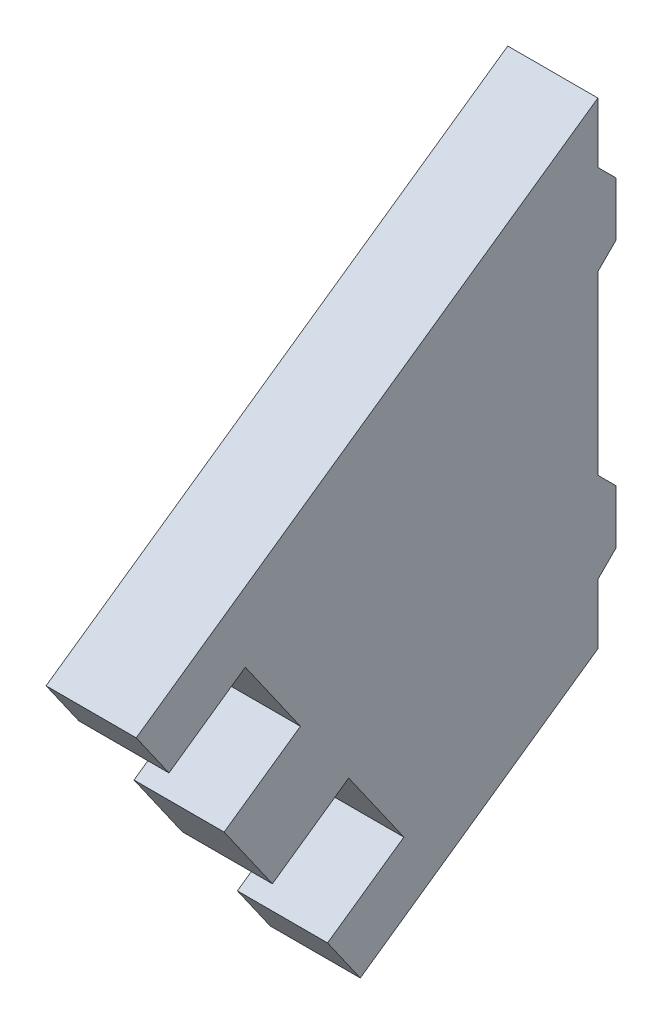
ISO-10303-21;
HEADER;
FILE_DESCRIPTION(('STEP AP214'),'2;1');
FILE_NAME('part.step','',(''),(''),'','','');
FILE_SCHEMA(('AUTOMOTIVE_DESIGN { 1 0 10303 214 1 1 1 1 }'));
ENDSEC;
DATA;
#1=APPLICATION_CONTEXT('core data for automotive mechanical design processes');
#2=APPLICATION_PROTOCOL_DEFINITION('international standard','automotive_design',2000,#1);
#3=PRODUCT_CONTEXT('',#1,'mechanical');
#4=PRODUCT('Part','Part','',(#3));
#5=PRODUCT_RELATED_PRODUCT_CATEGORY('part','',(#4));
#6=PRODUCT_DEFINITION_FORMATION('','',#4);
#7=PRODUCT_DEFINITION_CONTEXT('part definition',#1,'design');
#8=PRODUCT_DEFINITION('design','',#6,#7);
#9=PRODUCT_DEFINITION_SHAPE('','',#8);
#10=(LENGTH_UNIT() NAMED_UNIT(*) SI_UNIT(.MILLI.,.METRE.));
#11=(NAMED_UNIT(*) PLANE_ANGLE_UNIT() SI_UNIT($,.RADIAN.));
#12=(NAMED_UNIT(*) SI_UNIT($,.STERADIAN.) SOLID_ANGLE_UNIT());
#13=UNCERTAINTY_MEASURE_WITH_UNIT(LENGTH_MEASURE(1.E-05),#10,'distance_accuracy_value','');
#14=(GEOMETRIC_REPRESENTATION_CONTEXT(3) GLOBAL_UNCERTAINTY_ASSIGNED_CONTEXT((#13)) GLOBAL_UNIT_ASSIGNED_CONTEXT((#10,
#11,#12)) REPRESENTATION_CONTEXT('',''));
#15=CARTESIAN_POINT('',(0.,0.,0.));
#16=DIRECTION('',(0.,0.,1.));
#17=DIRECTION('',(1.,0.,0.));
#18=AXIS2_PLACEMENT_3D('',#15,#16,#17);
#19=CARTESIAN_POINT('',(-653.,-209.350348269495,0.));
#20=DIRECTION('',(0.,0.,1.));
#21=DIRECTION('',(0.,-1.,0.));
#22=AXIS2_PLACEMENT_3D('',#19,#20,#21);
#23=PLANE('',#22);
#24=CARTESIAN_POINT('',(-653.,-184.350348269495,0.));
#25=CARTESIAN_POINT('',(-668.,-184.350348269495,0.));
#26=B_SPLINE_CURVE_WITH_KNOTS('',1,(#24,#25),.UNSPECIFIED.,.F.,.F.,(2,2),(0.,0.25),.UNSPECIFIED.);
#27=CARTESIAN_POINT('',(-653.,-184.350348269495,0.));
#28=VERTEX_POINT('',#27);
#29=CARTESIAN_POINT('',(-668.,-184.350348269495,0.));
#30=VERTEX_POINT('',#29);
#31=EDGE_CURVE('E207',#28,#30,#26,.T.);
#32=ORIENTED_EDGE('',*,*,#31,.T.);
#33=DIRECTION('',(0.,-1.,0.));
#34=VECTOR('',#33,1.);
#35=CARTESIAN_POINT('',(-668.,-209.350348269495,0.));
#36=LINE('',#35,#34);
#37=CARTESIAN_POINT('',(-668.,-155.,0.));
#38=VERTEX_POINT('',#37);
#39=EDGE_CURVE('E396',#38,#30,#36,.T.);
#40=ORIENTED_EDGE('',*,*,#39,.F.);
#41=CARTESIAN_POINT('',(-668.,-155.,0.));
#42=CARTESIAN_POINT('',(-653.,-155.,0.));
#43=B_SPLINE_CURVE_WITH_KNOTS('',1,(#41,#42),.UNSPECIFIED.,.F.,.F.,(2,2),(0.5,0.75),.UNSPECIFIED.);
#44=CARTESIAN_POINT('',(-653.,-155.,0.));
#45=VERTEX_POINT('',#44);
#46=EDGE_CURVE('E243',#38,#45,#43,.T.);
#47=ORIENTED_EDGE('',*,*,#46,.T.);
#48=DIRECTION('',(0.,-1.,0.));
#49=VECTOR('',#48,1.);
#50=CARTESIAN_POINT('',(-653.,-209.350348269495,0.));
#51=LINE('',#50,#49);
#52=EDGE_CURVE('E200',#45,#28,#51,.T.);
#53=ORIENTED_EDGE('',*,*,#52,.T.);
#54=EDGE_LOOP('',(#32,#40,#47,#53));
#55=FACE_BOUND('',#54,.T.);
#56=ADVANCED_FACE('F41',(#55),#23,.F.);
#57=CARTESIAN_POINT('',(-668.,-199.350348269495,0.));
#58=CARTESIAN_POINT('',(-653.,-199.350348269495,0.));
#59=B_SPLINE_CURVE_WITH_KNOTS('',1,(#57,#58),.UNSPECIFIED.,.F.,.F.,(2,2),(0.5,0.75),.UNSPECIFIED.);
#60=CARTESIAN_POINT('',(-668.,-199.350348269495,0.));
#61=VERTEX_POINT('',#60);
#62=CARTESIAN_POINT('',(-653.,-199.350348269495,0.));
#63=VERTEX_POINT('',#62);
#64=EDGE_CURVE('E185',#61,#63,#59,.T.);
#65=ORIENTED_EDGE('',*,*,#64,.T.);
#66=CARTESIAN_POINT('',(-653.,-209.350348269495,0.));
#67=VERTEX_POINT('',#66);
#68=EDGE_CURVE('E192',#63,#67,#51,.T.);
#69=ORIENTED_EDGE('',*,*,#68,.T.);
#70=DIRECTION('',(-1.,0.,0.));
#71=VECTOR('',#70,1.);
#72=CARTESIAN_POINT('',(-653.,-209.350348269495,0.));
#73=LINE('',#72,#71);
#74=CARTESIAN_POINT('',(-668.,-209.350348269495,0.));
#75=VERTEX_POINT('',#74);
#76=EDGE_CURVE('E419',#67,#75,#73,.T.);
#77=ORIENTED_EDGE('',*,*,#76,.T.);
#78=EDGE_CURVE('E205',#61,#75,#36,.T.);
#79=ORIENTED_EDGE('',*,*,#78,.F.);
#80=EDGE_LOOP('',(#65,#69,#77,#79));
#81=FACE_BOUND('',#80,.T.);
#82=ADVANCED_FACE('F204',(#81),#23,.F.);
#83=CARTESIAN_POINT('',(-653.,-140.,0.));
#84=CARTESIAN_POINT('',(-668.,-140.,0.));
#85=B_SPLINE_CURVE_WITH_KNOTS('',1,(#83,#84),.UNSPECIFIED.,.F.,.F.,(2,2),(0.,0.25),.UNSPECIFIED.);
#86=CARTESIAN_POINT('',(-653.,-140.,0.));
#87=VERTEX_POINT('',#86);
#88=CARTESIAN_POINT('',(-668.,-140.,0.));
#89=VERTEX_POINT('',#88);
#90=EDGE_CURVE('E242',#87,#89,#85,.T.);
#91=ORIENTED_EDGE('',*,*,#90,.T.);
#92=CARTESIAN_POINT('',(-668.,-130.,0.));
#93=VERTEX_POINT('',#92);
#94=EDGE_CURVE('E399',#93,#89,#36,.T.);
#95=ORIENTED_EDGE('',*,*,#94,.F.);
#96=DIRECTION('',(-1.,0.,0.));
#97=VECTOR('',#96,1.);
#98=CARTESIAN_POINT('',(-653.,-130.,0.));
#99=LINE('',#98,#97);
#100=CARTESIAN_POINT('',(-653.,-130.,0.));
#101=VERTEX_POINT('',#100);
#102=EDGE_CURVE('E410',#101,#93,#99,.T.);
#103=ORIENTED_EDGE('',*,*,#102,.F.);
#104=EDGE_CURVE('E203',#101,#87,#51,.T.);
#105=ORIENTED_EDGE('',*,*,#104,.T.);
#106=EDGE_LOOP('',(#91,#95,#103,#105));
#107=FACE_BOUND('',#106,.T.);
#108=ADVANCED_FACE('F43',(#107),#23,.F.);
#109=CARTESIAN_POINT('',(-653.,-183.785541406649,76.8137137514509));
#110=DIRECTION('',(0.,0.57357643635105,-0.819152044288989));
#111=DIRECTION('',(0.,0.819152044288989,0.57357643635105));
#112=AXIS2_PLACEMENT_3D('',#109,#110,#111);
#113=PLANE('',#112);
#114=DIRECTION('',(0.,0.819152044288989,0.57357643635105));
#115=VECTOR('',#114,1.);
#116=CARTESIAN_POINT('',(-668.,-183.785541406649,76.8137137514509));
#117=LINE('',#116,#115);
#118=CARTESIAN_POINT('',(-668.,-237.030424285434,39.5312453886326));
#119=VERTEX_POINT('',#118);
#120=CARTESIAN_POINT('',(-668.,-229.248479864688,44.9802215339676));
#121=VERTEX_POINT('',#120);
#122=EDGE_CURVE('E405',#119,#121,#117,.T.);
#123=ORIENTED_EDGE('',*,*,#122,.F.);
#124=DIRECTION('',(-1.,0.,0.));
#125=VECTOR('',#124,1.);
#126=CARTESIAN_POINT('',(-653.,-237.030424285434,39.5312453886326));
#127=LINE('',#126,#125);
#128=CARTESIAN_POINT('',(-653.,-237.030424285434,39.5312453886326));
#129=VERTEX_POINT('',#128);
#130=EDGE_CURVE('E416',#129,#119,#127,.T.);
#131=ORIENTED_EDGE('',*,*,#130,.F.);
#132=DIRECTION('',(0.,0.819152044288989,0.57357643635105));
#133=VECTOR('',#132,1.);
#134=CARTESIAN_POINT('',(-653.,-183.785541406649,76.8137137514509));
#135=LINE('',#134,#133);
#136=CARTESIAN_POINT('',(-653.,-229.248479864688,44.9802215339676));
#137=VERTEX_POINT('',#136);
#138=EDGE_CURVE('E319',#129,#137,#135,.T.);
#139=ORIENTED_EDGE('',*,*,#138,.T.);
#140=DIRECTION('',(1.,0.,0.));
#141=VECTOR('',#140,1.);
#142=CARTESIAN_POINT('',(-653.,-229.248479864688,44.9802215339676));
#143=LINE('',#142,#141);
#144=EDGE_CURVE('E372',#121,#137,#143,.T.);
#145=ORIENTED_EDGE('',*,*,#144,.F.);
#146=EDGE_LOOP('',(#123,#131,#139,#145));
#147=FACE_BOUND('',#146,.T.);
#148=ADVANCED_FACE('F473',(#147),#113,.F.);
#149=CARTESIAN_POINT('',(-653.,-216.142047156064,54.1574445155844));
#150=VERTEX_POINT('',#149);
#151=CARTESIAN_POINT('',(-653.,-204.673918536019,62.1875146244991));
#152=VERTEX_POINT('',#151);
#153=EDGE_CURVE('E326',#150,#152,#135,.T.);
#154=ORIENTED_EDGE('',*,*,#153,.T.);
#155=DIRECTION('',(1.,0.,0.));
#156=VECTOR('',#155,1.);
#157=CARTESIAN_POINT('',(-653.,-204.673918536019,62.1875146244991));
#158=LINE('',#157,#156);
#159=CARTESIAN_POINT('',(-668.,-204.673918536019,62.1875146244991));
#160=VERTEX_POINT('',#159);
#161=EDGE_CURVE('E365',#160,#152,#158,.T.);
#162=ORIENTED_EDGE('',*,*,#161,.F.);
#163=CARTESIAN_POINT('',(-668.,-216.142047156064,54.1574445155844));
#164=VERTEX_POINT('',#163);
#165=EDGE_CURVE('E408',#164,#160,#117,.T.);
#166=ORIENTED_EDGE('',*,*,#165,.F.);
#167=DIRECTION('',(-1.,0.,0.));
#168=VECTOR('',#167,1.);
#169=CARTESIAN_POINT('',(-653.,-216.142047156064,54.1574445155844));
#170=LINE('',#169,#168);
#171=EDGE_CURVE('E369',#150,#164,#170,.T.);
#172=ORIENTED_EDGE('',*,*,#171,.F.);
#173=EDGE_LOOP('',(#154,#162,#166,#172));
#174=FACE_BOUND('',#173,.T.);
#175=ADVANCED_FACE('F441',(#174),#113,.F.);
#176=CARTESIAN_POINT('',(-653.,-237.030424285434,39.5312453886326));
#177=DIRECTION('',(0.,0.819152044288989,0.57357643635105));
#178=DIRECTION('',(0.,-0.57357643635105,0.819152044288989));
#179=AXIS2_PLACEMENT_3D('',#176,#177,#178);
#180=PLANE('',#179);
#181=DIRECTION('',(0.,-0.57357643635105,0.819152044288989));
#182=VECTOR('',#181,1.);
#183=CARTESIAN_POINT('',(-668.,-237.030424285434,39.5312453886326));
#184=LINE('',#183,#182);
#185=EDGE_CURVE('E401',#75,#119,#184,.T.);
#186=ORIENTED_EDGE('',*,*,#185,.F.);
#187=ORIENTED_EDGE('',*,*,#76,.F.);
#188=DIRECTION('',(0.,-0.57357643635105,0.819152044288989));
#189=VECTOR('',#188,1.);
#190=CARTESIAN_POINT('',(-653.,-237.030424285434,39.5312453886326));
#191=LINE('',#190,#189);
#192=EDGE_CURVE('E195',#67,#129,#191,.T.);
#193=ORIENTED_EDGE('',*,*,#192,.T.);
#194=ORIENTED_EDGE('',*,*,#130,.T.);
#195=EDGE_LOOP('',(#186,#187,#193,#194));
#196=FACE_BOUND('',#195,.T.);
#197=ADVANCED_FACE('F475',(#196),#180,.F.);
#198=CARTESIAN_POINT('',(-653.,-191.567485827395,71.3647376061159));
#199=VERTEX_POINT('',#198);
#200=CARTESIAN_POINT('',(-653.,-183.785541406649,76.8137137514509));
#201=VERTEX_POINT('',#200);
#202=EDGE_CURVE('E327',#199,#201,#135,.T.);
#203=ORIENTED_EDGE('',*,*,#202,.T.);
#204=DIRECTION('',(-1.,0.,0.));
#205=VECTOR('',#204,1.);
#206=CARTESIAN_POINT('',(-653.,-183.785541406649,76.8137137514509));
#207=LINE('',#206,#205);
#208=CARTESIAN_POINT('',(-668.,-183.785541406649,76.8137137514509));
#209=VERTEX_POINT('',#208);
#210=EDGE_CURVE('E413',#201,#209,#207,.T.);
#211=ORIENTED_EDGE('',*,*,#210,.T.);
#212=CARTESIAN_POINT('',(-668.,-191.567485827395,71.3647376061159));
#213=VERTEX_POINT('',#212);
#214=EDGE_CURVE('E404',#213,#209,#117,.T.);
#215=ORIENTED_EDGE('',*,*,#214,.F.);
#216=DIRECTION('',(-1.,0.,0.));
#217=VECTOR('',#216,1.);
#218=CARTESIAN_POINT('',(-653.,-191.567485827395,71.3647376061159));
#219=LINE('',#218,#217);
#220=EDGE_CURVE('E362',#199,#213,#219,.T.);
#221=ORIENTED_EDGE('',*,*,#220,.F.);
#222=EDGE_LOOP('',(#203,#211,#215,#221));
#223=FACE_BOUND('',#222,.T.);
#224=ADVANCED_FACE('F431',(#223),#113,.F.);
#225=CARTESIAN_POINT('',(-653.,-130.,0.));
#226=DIRECTION('',(0.,-0.819152044288989,-0.57357643635105));
#227=DIRECTION('',(0.,0.57357643635105,-0.819152044288989));
#228=AXIS2_PLACEMENT_3D('',#225,#226,#227);
#229=PLANE('',#228);
#230=DIRECTION('',(0.,0.57357643635105,-0.819152044288989));
#231=VECTOR('',#230,1.);
#232=CARTESIAN_POINT('',(-668.,-130.,0.));
#233=LINE('',#232,#231);
#234=EDGE_CURVE('E201',#209,#93,#233,.T.);
#235=ORIENTED_EDGE('',*,*,#234,.F.);
#236=ORIENTED_EDGE('',*,*,#210,.F.);
#237=DIRECTION('',(0.,0.57357643635105,-0.819152044288989));
#238=VECTOR('',#237,1.);
#239=CARTESIAN_POINT('',(-653.,-130.,0.));
#240=LINE('',#239,#238);
#241=EDGE_CURVE('E325',#201,#101,#240,.T.);
#242=ORIENTED_EDGE('',*,*,#241,.T.);
#243=ORIENTED_EDGE('',*,*,#102,.T.);
#244=EDGE_LOOP('',(#235,#236,#242,#243));
#245=FACE_BOUND('',#244,.T.);
#246=ADVANCED_FACE('F488',(#245),#229,.F.);
#247=CARTESIAN_POINT('',(-653.,0.,0.));
#248=DIRECTION('',(-1.,0.,0.));
#249=DIRECTION('',(0.,0.,-1.));
#250=AXIS2_PLACEMENT_3D('',#247,#248,#249);
#251=PLANE('',#250);
#252=ORIENTED_EDGE('',*,*,#138,.F.);
#253=ORIENTED_EDGE('',*,*,#192,.F.);
#254=ORIENTED_EDGE('',*,*,#68,.F.);
#255=DIRECTION('',(0.,-0.707106781186548,0.707106781186547));
#256=VECTOR('',#255,1.);
#257=CARTESIAN_POINT('',(-653.,-196.350348269495,-3.));
#258=LINE('',#257,#256);
#259=CARTESIAN_POINT('',(-653.,-196.350348269495,-3.));
#260=VERTEX_POINT('',#259);
#261=EDGE_CURVE('E181',#260,#63,#258,.T.);
#262=ORIENTED_EDGE('',*,*,#261,.F.);
#263=DIRECTION('',(0.,1.,0.));
#264=VECTOR('',#263,1.);
#265=CARTESIAN_POINT('',(-653.,-199.350348269495,-3.));
#266=LINE('',#265,#264);
#267=CARTESIAN_POINT('',(-653.,-187.350348269495,-3.));
#268=VERTEX_POINT('',#267);
#269=EDGE_CURVE('E206',#260,#268,#266,.T.);
#270=ORIENTED_EDGE('',*,*,#269,.T.);
#271=DIRECTION('',(0.,-0.707106781186548,-0.707106781186547));
#272=VECTOR('',#271,1.);
#273=CARTESIAN_POINT('',(-653.,-187.350348269495,-3.));
#274=LINE('',#273,#272);
#275=EDGE_CURVE('E56',#28,#268,#274,.T.);
#276=ORIENTED_EDGE('',*,*,#275,.F.);
#277=ORIENTED_EDGE('',*,*,#52,.F.);
#278=DIRECTION('',(0.,-0.707106781186548,0.707106781186547));
#279=VECTOR('',#278,1.);
#280=CARTESIAN_POINT('',(-653.,-152.,-3.));
#281=LINE('',#280,#279);
#282=CARTESIAN_POINT('',(-653.,-152.,-3.));
#283=VERTEX_POINT('',#282);
#284=EDGE_CURVE('E278',#283,#45,#281,.T.);
#285=ORIENTED_EDGE('',*,*,#284,.F.);
#286=DIRECTION('',(0.,1.,0.));
#287=VECTOR('',#286,1.);
#288=CARTESIAN_POINT('',(-653.,-155.,-3.));
#289=LINE('',#288,#287);
#290=CARTESIAN_POINT('',(-653.,-143.,-3.));
#291=VERTEX_POINT('',#290);
#292=EDGE_CURVE('E248',#283,#291,#289,.T.);
#293=ORIENTED_EDGE('',*,*,#292,.T.);
#294=DIRECTION('',(0.,-0.707106781186548,-0.707106781186547));
#295=VECTOR('',#294,1.);
#296=CARTESIAN_POINT('',(-653.,-143.,-3.));
#297=LINE('',#296,#295);
#298=EDGE_CURVE('E274',#87,#291,#297,.T.);
#299=ORIENTED_EDGE('',*,*,#298,.F.);
#300=ORIENTED_EDGE('',*,*,#104,.F.);
#301=ORIENTED_EDGE('',*,*,#241,.F.);
#302=ORIENTED_EDGE('',*,*,#202,.F.);
#303=CARTESIAN_POINT('',(-653.,-191.85427404557,71.7743136282604));
#304=CARTESIAN_POINT('',(-653.,-182.677051063953,58.6678809196366));
#305=B_SPLINE_CURVE_WITH_KNOTS('',1,(#303,#304),.UNSPECIFIED.,.F.,.F.,(2,2),(0.,0.25),.UNSPECIFIED.);
#306=CARTESIAN_POINT('',(-653.,-182.677051063953,58.6678809196366));
#307=VERTEX_POINT('',#306);
#308=EDGE_CURVE('E287',#199,#307,#305,.T.);
#309=ORIENTED_EDGE('',*,*,#308,.T.);
#310=CARTESIAN_POINT('',(-653.,-182.677051063953,58.6678809196366));
#311=CARTESIAN_POINT('',(-653.,-195.783483772577,49.4906579380198));
#312=B_SPLINE_CURVE_WITH_KNOTS('',1,(#310,#311),.UNSPECIFIED.,.F.,.F.,(2,2),(0.25,0.5),.UNSPECIFIED.);
#313=CARTESIAN_POINT('',(-653.,-195.783483772577,49.4906579380198));
#314=VERTEX_POINT('',#313);
#315=EDGE_CURVE('E345',#307,#314,#312,.T.);
#316=ORIENTED_EDGE('',*,*,#315,.T.);
#317=CARTESIAN_POINT('',(-653.,-195.783483772577,49.4906579380198));
#318=CARTESIAN_POINT('',(-653.,-204.960706754194,62.5970906466436));
#319=B_SPLINE_CURVE_WITH_KNOTS('',1,(#317,#318),.UNSPECIFIED.,.F.,.F.,(2,2),(0.5,0.75),.UNSPECIFIED.);
#320=EDGE_CURVE('E356',#314,#152,#319,.T.);
#321=ORIENTED_EDGE('',*,*,#320,.T.);
#322=ORIENTED_EDGE('',*,*,#153,.F.);
#323=CARTESIAN_POINT('',(-653.,-216.42883537424,54.5670205377289));
#324=CARTESIAN_POINT('',(-653.,-207.251612392623,41.4605878291051));
#325=B_SPLINE_CURVE_WITH_KNOTS('',1,(#323,#324),.UNSPECIFIED.,.F.,.F.,(2,2),(0.,0.25),.UNSPECIFIED.);
#326=CARTESIAN_POINT('',(-653.,-207.251612392623,41.4605878291051));
#327=VERTEX_POINT('',#326);
#328=EDGE_CURVE('E305',#150,#327,#325,.T.);
#329=ORIENTED_EDGE('',*,*,#328,.T.);
#330=CARTESIAN_POINT('',(-653.,-207.251612392623,41.4605878291051));
#331=CARTESIAN_POINT('',(-653.,-220.358045101247,32.2833648474883));
#332=B_SPLINE_CURVE_WITH_KNOTS('',1,(#330,#331),.UNSPECIFIED.,.F.,.F.,(2,2),(0.25,0.5),.UNSPECIFIED.);
#333=CARTESIAN_POINT('',(-653.,-220.358045101247,32.2833648474883));
#334=VERTEX_POINT('',#333);
#335=EDGE_CURVE('E295',#327,#334,#332,.T.);
#336=ORIENTED_EDGE('',*,*,#335,.T.);
#337=CARTESIAN_POINT('',(-653.,-220.358045101247,32.2833648474883));
#338=CARTESIAN_POINT('',(-653.,-229.535268082864,45.3897975561121));
#339=B_SPLINE_CURVE_WITH_KNOTS('',1,(#337,#338),.UNSPECIFIED.,.F.,.F.,(2,2),(0.5,0.75),.UNSPECIFIED.);
#340=EDGE_CURVE('E288',#334,#137,#339,.T.);
#341=ORIENTED_EDGE('',*,*,#340,.T.);
#342=EDGE_LOOP('',(#252,#253,#254,#262,#270,#276,#277,#285,#293,#299,#300,#301,#302,#309,#316,
#321,#322,#329,#336,#341));
#343=FACE_BOUND('',#342,.T.);
#344=ADVANCED_FACE('F194',(#343),#251,.F.);
#345=CARTESIAN_POINT('',(-668.,0.,0.));
#346=DIRECTION('',(-1.,0.,0.));
#347=DIRECTION('',(0.,0.,-1.));
#348=AXIS2_PLACEMENT_3D('',#345,#346,#347);
#349=PLANE('',#348);
#350=DIRECTION('',(0.,-0.57357643635105,0.819152044288989));
#351=VECTOR('',#350,1.);
#352=CARTESIAN_POINT('',(-668.,-220.358045101247,32.2833648474883));
#353=LINE('',#352,#351);
#354=CARTESIAN_POINT('',(-668.,-220.358045101247,32.2833648474883));
#355=VERTEX_POINT('',#354);
#356=EDGE_CURVE('E461',#355,#121,#353,.T.);
#357=ORIENTED_EDGE('',*,*,#356,.F.);
#358=DIRECTION('',(0.,-0.819152044288989,-0.57357643635105));
#359=VECTOR('',#358,1.);
#360=CARTESIAN_POINT('',(-668.,-207.251612392623,41.4605878291051));
#361=LINE('',#360,#359);
#362=CARTESIAN_POINT('',(-668.,-207.251612392623,41.4605878291051));
#363=VERTEX_POINT('',#362);
#364=EDGE_CURVE('E294',#363,#355,#361,.T.);
#365=ORIENTED_EDGE('',*,*,#364,.F.);
#366=DIRECTION('',(0.,-0.57357643635105,0.819152044288989));
#367=VECTOR('',#366,1.);
#368=CARTESIAN_POINT('',(-668.,-119.587815065583,-83.7362895869508));
#369=LINE('',#368,#367);
#370=EDGE_CURVE('E13',#363,#164,#369,.T.);
#371=ORIENTED_EDGE('',*,*,#370,.T.);
#372=ORIENTED_EDGE('',*,*,#165,.T.);
#373=DIRECTION('',(0.,-0.57357643635105,0.819152044288989));
#374=VECTOR('',#373,1.);
#375=CARTESIAN_POINT('',(-668.,-195.783483772577,49.4906579380198));
#376=LINE('',#375,#374);
#377=CARTESIAN_POINT('',(-668.,-195.783483772577,49.4906579380198));
#378=VERTEX_POINT('',#377);
#379=EDGE_CURVE('E357',#378,#160,#376,.T.);
#380=ORIENTED_EDGE('',*,*,#379,.F.);
#381=DIRECTION('',(0.,-0.819152044288989,-0.57357643635105));
#382=VECTOR('',#381,1.);
#383=CARTESIAN_POINT('',(-668.,-182.677051063953,58.6678809196366));
#384=LINE('',#383,#382);
#385=CARTESIAN_POINT('',(-668.,-182.677051063953,58.6678809196366));
#386=VERTEX_POINT('',#385);
#387=EDGE_CURVE('E349',#386,#378,#384,.T.);
#388=ORIENTED_EDGE('',*,*,#387,.F.);
#389=DIRECTION('',(0.,-0.57357643635105,0.819152044288989));
#390=VECTOR('',#389,1.);
#391=CARTESIAN_POINT('',(-668.,-95.0132537369133,-66.5289964964192));
#392=LINE('',#391,#390);
#393=EDGE_CURVE('E49',#386,#213,#392,.T.);
#394=ORIENTED_EDGE('',*,*,#393,.T.);
#395=ORIENTED_EDGE('',*,*,#214,.T.);
#396=ORIENTED_EDGE('',*,*,#234,.T.);
#397=ORIENTED_EDGE('',*,*,#94,.T.);
#398=DIRECTION('',(0.,0.707106781186548,0.707106781186547));
#399=VECTOR('',#398,1.);
#400=CARTESIAN_POINT('',(-668.,-143.,-3.));
#401=LINE('',#400,#399);
#402=CARTESIAN_POINT('',(-668.,-143.,-3.));
#403=VERTEX_POINT('',#402);
#404=EDGE_CURVE('E283',#403,#89,#401,.T.);
#405=ORIENTED_EDGE('',*,*,#404,.F.);
#406=DIRECTION('',(0.,-1.,0.));
#407=VECTOR('',#406,1.);
#408=CARTESIAN_POINT('',(-668.,-140.,-3.));
#409=LINE('',#408,#407);
#410=CARTESIAN_POINT('',(-668.,-152.,-3.));
#411=VERTEX_POINT('',#410);
#412=EDGE_CURVE('E256',#403,#411,#409,.T.);
#413=ORIENTED_EDGE('',*,*,#412,.T.);
#414=DIRECTION('',(0.,0.707106781186548,-0.707106781186547));
#415=VECTOR('',#414,1.);
#416=CARTESIAN_POINT('',(-668.,-152.,-3.));
#417=LINE('',#416,#415);
#418=EDGE_CURVE('E285',#38,#411,#417,.T.);
#419=ORIENTED_EDGE('',*,*,#418,.F.);
#420=ORIENTED_EDGE('',*,*,#39,.T.);
#421=DIRECTION('',(0.,0.707106781186548,0.707106781186547));
#422=VECTOR('',#421,1.);
#423=CARTESIAN_POINT('',(-668.,-187.350348269495,-3.));
#424=LINE('',#423,#422);
#425=CARTESIAN_POINT('',(-668.,-187.350348269495,-3.));
#426=VERTEX_POINT('',#425);
#427=EDGE_CURVE('E189',#426,#30,#424,.T.);
#428=ORIENTED_EDGE('',*,*,#427,.F.);
#429=DIRECTION('',(0.,-1.,0.));
#430=VECTOR('',#429,1.);
#431=CARTESIAN_POINT('',(-668.,-184.350348269495,-3.));
#432=LINE('',#431,#430);
#433=CARTESIAN_POINT('',(-668.,-196.350348269495,-3.));
#434=VERTEX_POINT('',#433);
#435=EDGE_CURVE('E210',#426,#434,#432,.T.);
#436=ORIENTED_EDGE('',*,*,#435,.T.);
#437=DIRECTION('',(0.,0.707106781186548,-0.707106781186547));
#438=VECTOR('',#437,1.);
#439=CARTESIAN_POINT('',(-668.,-196.350348269495,-3.));
#440=LINE('',#439,#438);
#441=EDGE_CURVE('E64',#61,#434,#440,.T.);
#442=ORIENTED_EDGE('',*,*,#441,.F.);
#443=ORIENTED_EDGE('',*,*,#78,.T.);
#444=ORIENTED_EDGE('',*,*,#185,.T.);
#445=ORIENTED_EDGE('',*,*,#122,.T.);
#446=EDGE_LOOP('',(#357,#365,#371,#372,#380,#388,#394,#395,#396,#397,#405,#413,#419,#420,#428,
#436,#442,#443,#444,#445));
#447=FACE_BOUND('',#446,.T.);
#448=ADVANCED_FACE('F398',(#447),#349,.T.);
#449=CARTESIAN_POINT('',(-683.,-195.783483772577,49.4906579380198));
#450=DIRECTION('',(0.,-0.819152044288989,-0.57357643635105));
#451=DIRECTION('',(0.,0.57357643635105,-0.819152044288989));
#452=AXIS2_PLACEMENT_3D('',#449,#450,#451);
#453=PLANE('',#452);
#454=ORIENTED_EDGE('',*,*,#379,.T.);
#455=ORIENTED_EDGE('',*,*,#161,.T.);
#456=ORIENTED_EDGE('',*,*,#320,.F.);
#457=DIRECTION('',(1.,0.,0.));
#458=VECTOR('',#457,1.);
#459=CARTESIAN_POINT('',(-683.,-195.783483772577,49.4906579380198));
#460=LINE('',#459,#458);
#461=EDGE_CURVE('E355',#378,#314,#460,.T.);
#462=ORIENTED_EDGE('',*,*,#461,.F.);
#463=EDGE_LOOP('',(#454,#455,#456,#462));
#464=FACE_BOUND('',#463,.T.);
#465=ADVANCED_FACE('F445',(#464),#453,.F.);
#466=CARTESIAN_POINT('',(-683.,-191.85427404557,71.7743136282604));
#467=DIRECTION('',(0.,0.819152044288989,0.57357643635105));
#468=DIRECTION('',(0.,-0.57357643635105,0.819152044288989));
#469=AXIS2_PLACEMENT_3D('',#466,#467,#468);
#470=PLANE('',#469);
#471=ORIENTED_EDGE('',*,*,#308,.F.);
#472=ORIENTED_EDGE('',*,*,#220,.T.);
#473=ORIENTED_EDGE('',*,*,#393,.F.);
#474=DIRECTION('',(1.,0.,0.));
#475=VECTOR('',#474,1.);
#476=CARTESIAN_POINT('',(-683.,-182.677051063953,58.6678809196366));
#477=LINE('',#476,#475);
#478=EDGE_CURVE('E359',#386,#307,#477,.T.);
#479=ORIENTED_EDGE('',*,*,#478,.T.);
#480=EDGE_LOOP('',(#471,#472,#473,#479));
#481=FACE_BOUND('',#480,.T.);
#482=ADVANCED_FACE('F427',(#481),#470,.F.);
#483=CARTESIAN_POINT('',(-683.,-182.677051063953,58.6678809196366));
#484=DIRECTION('',(0.,0.57357643635105,-0.819152044288989));
#485=DIRECTION('',(0.,0.819152044288989,0.57357643635105));
#486=AXIS2_PLACEMENT_3D('',#483,#484,#485);
#487=PLANE('',#486);
#488=ORIENTED_EDGE('',*,*,#478,.F.);
#489=ORIENTED_EDGE('',*,*,#387,.T.);
#490=ORIENTED_EDGE('',*,*,#461,.T.);
#491=ORIENTED_EDGE('',*,*,#315,.F.);
#492=EDGE_LOOP('',(#488,#489,#490,#491));
#493=FACE_BOUND('',#492,.T.);
#494=ADVANCED_FACE('F449',(#493),#487,.F.);
#495=CARTESIAN_POINT('',(-683.,-220.358045101247,32.2833648474883));
#496=DIRECTION('',(0.,-0.819152044288989,-0.57357643635105));
#497=DIRECTION('',(0.,0.57357643635105,-0.819152044288989));
#498=AXIS2_PLACEMENT_3D('',#495,#496,#497);
#499=PLANE('',#498);
#500=ORIENTED_EDGE('',*,*,#356,.T.);
#501=ORIENTED_EDGE('',*,*,#144,.T.);
#502=ORIENTED_EDGE('',*,*,#340,.F.);
#503=DIRECTION('',(1.,0.,0.));
#504=VECTOR('',#503,1.);
#505=CARTESIAN_POINT('',(-683.,-220.358045101247,32.2833648474883));
#506=LINE('',#505,#504);
#507=EDGE_CURVE('E464',#355,#334,#506,.T.);
#508=ORIENTED_EDGE('',*,*,#507,.F.);
#509=EDGE_LOOP('',(#500,#501,#502,#508));
#510=FACE_BOUND('',#509,.T.);
#511=ADVANCED_FACE('F468',(#510),#499,.F.);
#512=CARTESIAN_POINT('',(-683.,-216.42883537424,54.5670205377289));
#513=DIRECTION('',(0.,0.819152044288989,0.57357643635105));
#514=DIRECTION('',(0.,-0.57357643635105,0.819152044288989));
#515=AXIS2_PLACEMENT_3D('',#512,#513,#514);
#516=PLANE('',#515);
#517=ORIENTED_EDGE('',*,*,#328,.F.);
#518=ORIENTED_EDGE('',*,*,#171,.T.);
#519=ORIENTED_EDGE('',*,*,#370,.F.);
#520=DIRECTION('',(1.,0.,0.));
#521=VECTOR('',#520,1.);
#522=CARTESIAN_POINT('',(-683.,-207.251612392623,41.4605878291051));
#523=LINE('',#522,#521);
#524=EDGE_CURVE('E366',#363,#327,#523,.T.);
#525=ORIENTED_EDGE('',*,*,#524,.T.);
#526=EDGE_LOOP('',(#517,#518,#519,#525));
#527=FACE_BOUND('',#526,.T.);
#528=ADVANCED_FACE('F458',(#527),#516,.F.);
#529=CARTESIAN_POINT('',(-683.,-207.251612392623,41.4605878291051));
#530=DIRECTION('',(0.,0.57357643635105,-0.819152044288989));
#531=DIRECTION('',(0.,0.819152044288989,0.57357643635105));
#532=AXIS2_PLACEMENT_3D('',#529,#530,#531);
#533=PLANE('',#532);
#534=ORIENTED_EDGE('',*,*,#524,.F.);
#535=ORIENTED_EDGE('',*,*,#364,.T.);
#536=ORIENTED_EDGE('',*,*,#507,.T.);
#537=ORIENTED_EDGE('',*,*,#335,.F.);
#538=EDGE_LOOP('',(#534,#535,#536,#537));
#539=FACE_BOUND('',#538,.T.);
#540=ADVANCED_FACE('F463',(#539),#533,.F.);
#541=CARTESIAN_POINT('',(0.,0.,-3.));
#542=DIRECTION('',(0.,0.,-1.));
#543=DIRECTION('',(1.,0.,0.));
#544=AXIS2_PLACEMENT_3D('',#541,#542,#543);
#545=PLANE('',#544);
#546=ORIENTED_EDGE('',*,*,#412,.F.);
#547=DIRECTION('',(-1.,0.,0.));
#548=VECTOR('',#547,1.);
#549=CARTESIAN_POINT('',(-668.,-143.,-3.));
#550=LINE('',#549,#548);
#551=EDGE_CURVE('E262',#291,#403,#550,.T.);
#552=ORIENTED_EDGE('',*,*,#551,.F.);
#553=ORIENTED_EDGE('',*,*,#292,.F.);
#554=DIRECTION('',(1.,0.,0.));
#555=VECTOR('',#554,1.);
#556=CARTESIAN_POINT('',(-653.,-152.,-3.));
#557=LINE('',#556,#555);
#558=EDGE_CURVE('E279',#411,#283,#557,.T.);
#559=ORIENTED_EDGE('',*,*,#558,.F.);
#560=EDGE_LOOP('',(#546,#552,#553,#559));
#561=FACE_BOUND('',#560,.T.);
#562=ADVANCED_FACE('F506',(#561),#545,.T.);
#563=CARTESIAN_POINT('',(0.,-152.,-3.));
#564=DIRECTION('',(0.,-0.707106781186547,-0.707106781186548));
#565=DIRECTION('',(-1.,0.,0.));
#566=AXIS2_PLACEMENT_3D('',#563,#564,#565);
#567=PLANE('',#566);
#568=ORIENTED_EDGE('',*,*,#418,.T.);
#569=ORIENTED_EDGE('',*,*,#558,.T.);
#570=ORIENTED_EDGE('',*,*,#284,.T.);
#571=ORIENTED_EDGE('',*,*,#46,.F.);
#572=EDGE_LOOP('',(#568,#569,#570,#571));
#573=FACE_BOUND('',#572,.T.);
#574=ADVANCED_FACE('F508',(#573),#567,.T.);
#575=CARTESIAN_POINT('',(0.,-143.,-3.));
#576=DIRECTION('',(0.,0.707106781186547,-0.707106781186548));
#577=DIRECTION('',(1.,0.,0.));
#578=AXIS2_PLACEMENT_3D('',#575,#576,#577);
#579=PLANE('',#578);
#580=ORIENTED_EDGE('',*,*,#298,.T.);
#581=ORIENTED_EDGE('',*,*,#551,.T.);
#582=ORIENTED_EDGE('',*,*,#404,.T.);
#583=ORIENTED_EDGE('',*,*,#90,.F.);
#584=EDGE_LOOP('',(#580,#581,#582,#583));
#585=FACE_BOUND('',#584,.T.);
#586=ADVANCED_FACE('F500',(#585),#579,.T.);
#587=CARTESIAN_POINT('',(0.,0.,-3.));
#588=DIRECTION('',(0.,0.,-1.));
#589=DIRECTION('',(1.,0.,0.));
#590=AXIS2_PLACEMENT_3D('',#587,#588,#589);
#591=PLANE('',#590);
#592=ORIENTED_EDGE('',*,*,#435,.F.);
#593=DIRECTION('',(-1.,0.,0.));
#594=VECTOR('',#593,1.);
#595=CARTESIAN_POINT('',(-668.,-187.350348269495,-3.));
#596=LINE('',#595,#594);
#597=EDGE_CURVE('E225',#268,#426,#596,.T.);
#598=ORIENTED_EDGE('',*,*,#597,.F.);
#599=ORIENTED_EDGE('',*,*,#269,.F.);
#600=DIRECTION('',(1.,0.,0.));
#601=VECTOR('',#600,1.);
#602=CARTESIAN_POINT('',(-653.,-196.350348269495,-3.));
#603=LINE('',#602,#601);
#604=EDGE_CURVE('E186',#434,#260,#603,.T.);
#605=ORIENTED_EDGE('',*,*,#604,.F.);
#606=EDGE_LOOP('',(#592,#598,#599,#605));
#607=FACE_BOUND('',#606,.T.);
#608=ADVANCED_FACE('F515',(#607),#591,.T.);
#609=CARTESIAN_POINT('',(0.,-196.350348269495,-3.));
#610=DIRECTION('',(0.,-0.707106781186547,-0.707106781186548));
#611=DIRECTION('',(-1.,0.,0.));
#612=AXIS2_PLACEMENT_3D('',#609,#610,#611);
#613=PLANE('',#612);
#614=ORIENTED_EDGE('',*,*,#441,.T.);
#615=ORIENTED_EDGE('',*,*,#604,.T.);
#616=ORIENTED_EDGE('',*,*,#261,.T.);
#617=ORIENTED_EDGE('',*,*,#64,.F.);
#618=EDGE_LOOP('',(#614,#615,#616,#617));
#619=FACE_BOUND('',#618,.T.);
#620=ADVANCED_FACE('F183',(#619),#613,.T.);
#621=CARTESIAN_POINT('',(0.,-187.350348269495,-3.));
#622=DIRECTION('',(0.,0.707106781186547,-0.707106781186548));
#623=DIRECTION('',(1.,0.,0.));
#624=AXIS2_PLACEMENT_3D('',#621,#622,#623);
#625=PLANE('',#624);
#626=ORIENTED_EDGE('',*,*,#275,.T.);
#627=ORIENTED_EDGE('',*,*,#597,.T.);
#628=ORIENTED_EDGE('',*,*,#427,.T.);
#629=ORIENTED_EDGE('',*,*,#31,.F.);
#630=EDGE_LOOP('',(#626,#627,#628,#629));
#631=FACE_BOUND('',#630,.T.);
#632=ADVANCED_FACE('F392',(#631),#625,.T.);
#633=CLOSED_SHELL('',(#56,#82,#108,#148,#175,#197,#224,#246,#344,#448,#465,#482,#494,#511,#528,
#540,#562,#574,#586,#608,#620,#632));
#634=MANIFOLD_SOLID_BREP('B2',#633);
#635=ADVANCED_BREP_SHAPE_REPRESENTATION('',(#18,#634),#14);
#636=SHAPE_DEFINITION_REPRESENTATION(#9,#635);
ENDSEC;
END-ISO-10303-21;
